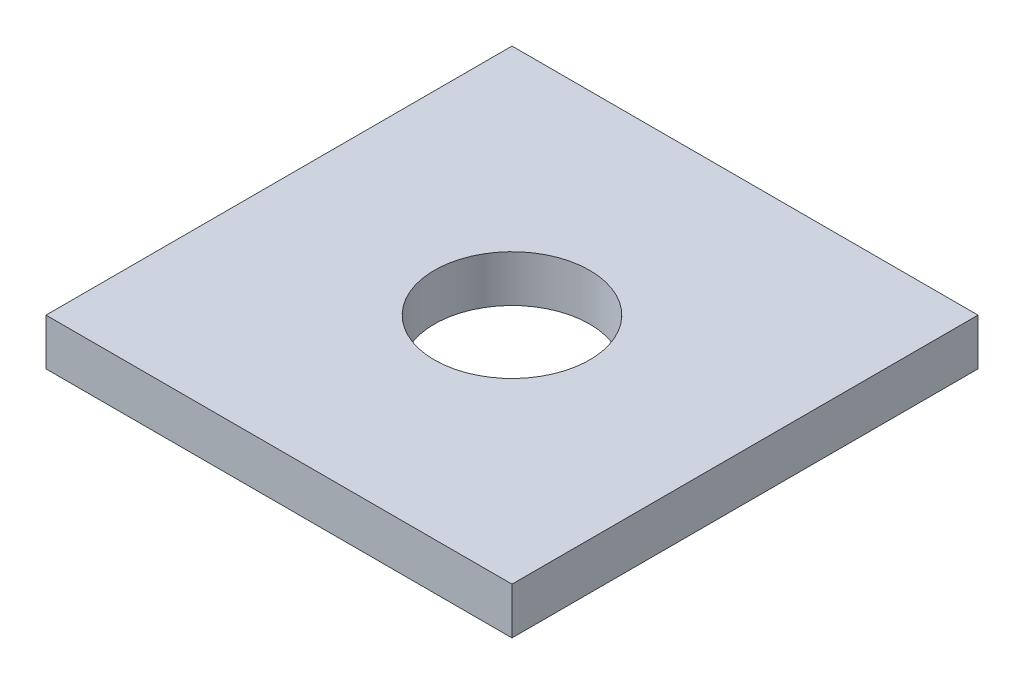
ISO-10303-21;
HEADER;
FILE_DESCRIPTION(('STEP AP214'),'2;1');
FILE_NAME('part.step','',(''),(''),'','','');
FILE_SCHEMA(('AUTOMOTIVE_DESIGN { 1 0 10303 214 1 1 1 1 }'));
ENDSEC;
DATA;
#1=APPLICATION_CONTEXT('core data for automotive mechanical design processes');
#2=APPLICATION_PROTOCOL_DEFINITION('international standard','automotive_design',2000,#1);
#3=PRODUCT_CONTEXT('',#1,'mechanical');
#4=PRODUCT('Part','Part','',(#3));
#5=PRODUCT_RELATED_PRODUCT_CATEGORY('part','',(#4));
#6=PRODUCT_DEFINITION_FORMATION('','',#4);
#7=PRODUCT_DEFINITION_CONTEXT('part definition',#1,'design');
#8=PRODUCT_DEFINITION('design','',#6,#7);
#9=PRODUCT_DEFINITION_SHAPE('','',#8);
#10=(LENGTH_UNIT() NAMED_UNIT(*) SI_UNIT(.MILLI.,.METRE.));
#11=(NAMED_UNIT(*) PLANE_ANGLE_UNIT() SI_UNIT($,.RADIAN.));
#12=(NAMED_UNIT(*) SI_UNIT($,.STERADIAN.) SOLID_ANGLE_UNIT());
#13=UNCERTAINTY_MEASURE_WITH_UNIT(LENGTH_MEASURE(1.E-05),#10,'distance_accuracy_value','');
#14=(GEOMETRIC_REPRESENTATION_CONTEXT(3) GLOBAL_UNCERTAINTY_ASSIGNED_CONTEXT((#13)) GLOBAL_UNIT_ASSIGNED_CONTEXT((#10,
#11,#12)) REPRESENTATION_CONTEXT('',''));
#15=CARTESIAN_POINT('',(0.,0.,0.));
#16=DIRECTION('',(0.,0.,1.));
#17=DIRECTION('',(1.,0.,0.));
#18=AXIS2_PLACEMENT_3D('',#15,#16,#17);
#19=CARTESIAN_POINT('',(0.,3.,0.));
#20=DIRECTION('',(0.,1.,0.));
#21=DIRECTION('',(0.,0.,1.));
#22=AXIS2_PLACEMENT_3D('',#19,#20,#21);
#23=PLANE('',#22);
#24=DIRECTION('',(0.,0.,1.));
#25=VECTOR('',#24,1.);
#26=CARTESIAN_POINT('',(-15.,3.,-15.));
#27=LINE('',#26,#25);
#28=CARTESIAN_POINT('',(-15.,3.,-15.));
#29=VERTEX_POINT('',#28);
#30=CARTESIAN_POINT('',(-15.,3.,15.));
#31=VERTEX_POINT('',#30);
#32=EDGE_CURVE('E85',#29,#31,#27,.T.);
#33=ORIENTED_EDGE('',*,*,#32,.T.);
#34=DIRECTION('',(1.,0.,0.));
#35=VECTOR('',#34,1.);
#36=CARTESIAN_POINT('',(-15.,3.,15.));
#37=LINE('',#36,#35);
#38=CARTESIAN_POINT('',(15.,3.,15.));
#39=VERTEX_POINT('',#38);
#40=EDGE_CURVE('E80',#31,#39,#37,.T.);
#41=ORIENTED_EDGE('',*,*,#40,.T.);
#42=DIRECTION('',(0.,0.,-1.));
#43=VECTOR('',#42,1.);
#44=CARTESIAN_POINT('',(15.,3.,-15.));
#45=LINE('',#44,#43);
#46=CARTESIAN_POINT('',(15.,3.,-15.));
#47=VERTEX_POINT('',#46);
#48=EDGE_CURVE('E83',#39,#47,#45,.T.);
#49=ORIENTED_EDGE('',*,*,#48,.T.);
#50=DIRECTION('',(-1.,0.,0.));
#51=VECTOR('',#50,1.);
#52=CARTESIAN_POINT('',(-15.,3.,-15.));
#53=LINE('',#52,#51);
#54=EDGE_CURVE('E50',#47,#29,#53,.T.);
#55=ORIENTED_EDGE('',*,*,#54,.T.);
#56=EDGE_LOOP('',(#33,#41,#49,#55));
#57=FACE_BOUND('',#56,.T.);
#58=CARTESIAN_POINT('',(0.,3.,0.));
#59=DIRECTION('',(0.,1.,0.));
#60=DIRECTION('',(0.,0.,1.));
#61=AXIS2_PLACEMENT_3D('',#58,#59,#60);
#62=CIRCLE('',#61,5.);
#63=CARTESIAN_POINT('',(0.,3.,5.));
#64=VERTEX_POINT('',#63);
#65=EDGE_CURVE('E100',#64,#64,#62,.T.);
#66=ORIENTED_EDGE('',*,*,#65,.F.);
#67=EDGE_LOOP('',(#66));
#68=FACE_BOUND('',#67,.T.);
#69=ADVANCED_FACE('F33',(#57,#68),#23,.T.);
#70=CARTESIAN_POINT('',(0.,0.,0.));
#71=DIRECTION('',(0.,1.,0.));
#72=DIRECTION('',(0.,0.,1.));
#73=AXIS2_PLACEMENT_3D('',#70,#71,#72);
#74=PLANE('',#73);
#75=DIRECTION('',(0.,0.,1.));
#76=VECTOR('',#75,1.);
#77=CARTESIAN_POINT('',(-15.,0.,-15.));
#78=LINE('',#77,#76);
#79=CARTESIAN_POINT('',(-15.,0.,-15.));
#80=VERTEX_POINT('',#79);
#81=CARTESIAN_POINT('',(-15.,0.,15.));
#82=VERTEX_POINT('',#81);
#83=EDGE_CURVE('E97',#80,#82,#78,.T.);
#84=ORIENTED_EDGE('',*,*,#83,.F.);
#85=DIRECTION('',(-1.,0.,0.));
#86=VECTOR('',#85,1.);
#87=CARTESIAN_POINT('',(-15.,0.,-15.));
#88=LINE('',#87,#86);
#89=CARTESIAN_POINT('',(15.,0.,-15.));
#90=VERTEX_POINT('',#89);
#91=EDGE_CURVE('E73',#90,#80,#88,.T.);
#92=ORIENTED_EDGE('',*,*,#91,.F.);
#93=DIRECTION('',(0.,0.,-1.));
#94=VECTOR('',#93,1.);
#95=CARTESIAN_POINT('',(15.,0.,-15.));
#96=LINE('',#95,#94);
#97=CARTESIAN_POINT('',(15.,0.,15.));
#98=VERTEX_POINT('',#97);
#99=EDGE_CURVE('E67',#98,#90,#96,.T.);
#100=ORIENTED_EDGE('',*,*,#99,.F.);
#101=DIRECTION('',(1.,0.,0.));
#102=VECTOR('',#101,1.);
#103=CARTESIAN_POINT('',(-15.,0.,15.));
#104=LINE('',#103,#102);
#105=EDGE_CURVE('E89',#82,#98,#104,.T.);
#106=ORIENTED_EDGE('',*,*,#105,.F.);
#107=EDGE_LOOP('',(#84,#92,#100,#106));
#108=FACE_BOUND('',#107,.T.);
#109=CARTESIAN_POINT('',(0.,0.,0.));
#110=DIRECTION('',(0.,1.,0.));
#111=DIRECTION('',(0.,0.,1.));
#112=AXIS2_PLACEMENT_3D('',#109,#110,#111);
#113=CIRCLE('',#112,5.);
#114=CARTESIAN_POINT('',(0.,0.,5.));
#115=VERTEX_POINT('',#114);
#116=EDGE_CURVE('E112',#115,#115,#113,.T.);
#117=ORIENTED_EDGE('',*,*,#116,.T.);
#118=EDGE_LOOP('',(#117));
#119=FACE_BOUND('',#118,.T.);
#120=ADVANCED_FACE('F108',(#108,#119),#74,.F.);
#121=CARTESIAN_POINT('',(-15.,3.,-15.));
#122=DIRECTION('',(1.,0.,0.));
#123=DIRECTION('',(0.,0.,-1.));
#124=AXIS2_PLACEMENT_3D('',#121,#122,#123);
#125=PLANE('',#124);
#126=ORIENTED_EDGE('',*,*,#83,.T.);
#127=DIRECTION('',(0.,-1.,0.));
#128=VECTOR('',#127,1.);
#129=CARTESIAN_POINT('',(-15.,3.,15.));
#130=LINE('',#129,#128);
#131=EDGE_CURVE('E11',#31,#82,#130,.T.);
#132=ORIENTED_EDGE('',*,*,#131,.F.);
#133=ORIENTED_EDGE('',*,*,#32,.F.);
#134=DIRECTION('',(0.,-1.,0.));
#135=VECTOR('',#134,1.);
#136=CARTESIAN_POINT('',(-15.,3.,-15.));
#137=LINE('',#136,#135);
#138=EDGE_CURVE('E93',#29,#80,#137,.T.);
#139=ORIENTED_EDGE('',*,*,#138,.T.);
#140=EDGE_LOOP('',(#126,#132,#133,#139));
#141=FACE_BOUND('',#140,.T.);
#142=ADVANCED_FACE('F35',(#141),#125,.F.);
#143=CARTESIAN_POINT('',(-15.,3.,15.));
#144=DIRECTION('',(0.,0.,-1.));
#145=DIRECTION('',(-1.,0.,0.));
#146=AXIS2_PLACEMENT_3D('',#143,#144,#145);
#147=PLANE('',#146);
#148=ORIENTED_EDGE('',*,*,#105,.T.);
#149=DIRECTION('',(0.,-1.,0.));
#150=VECTOR('',#149,1.);
#151=CARTESIAN_POINT('',(15.,3.,15.));
#152=LINE('',#151,#150);
#153=EDGE_CURVE('E42',#39,#98,#152,.T.);
#154=ORIENTED_EDGE('',*,*,#153,.F.);
#155=ORIENTED_EDGE('',*,*,#40,.F.);
#156=ORIENTED_EDGE('',*,*,#131,.T.);
#157=EDGE_LOOP('',(#148,#154,#155,#156));
#158=FACE_BOUND('',#157,.T.);
#159=ADVANCED_FACE('F88',(#158),#147,.F.);
#160=CARTESIAN_POINT('',(15.,3.,-15.));
#161=DIRECTION('',(-1.,0.,0.));
#162=DIRECTION('',(0.,0.,1.));
#163=AXIS2_PLACEMENT_3D('',#160,#161,#162);
#164=PLANE('',#163);
#165=ORIENTED_EDGE('',*,*,#99,.T.);
#166=DIRECTION('',(0.,-1.,0.));
#167=VECTOR('',#166,1.);
#168=CARTESIAN_POINT('',(15.,3.,-15.));
#169=LINE('',#168,#167);
#170=EDGE_CURVE('E90',#47,#90,#169,.T.);
#171=ORIENTED_EDGE('',*,*,#170,.F.);
#172=ORIENTED_EDGE('',*,*,#48,.F.);
#173=ORIENTED_EDGE('',*,*,#153,.T.);
#174=EDGE_LOOP('',(#165,#171,#172,#173));
#175=FACE_BOUND('',#174,.T.);
#176=ADVANCED_FACE('F91',(#175),#164,.F.);
#177=CARTESIAN_POINT('',(-15.,3.,-15.));
#178=DIRECTION('',(0.,0.,1.));
#179=DIRECTION('',(1.,0.,0.));
#180=AXIS2_PLACEMENT_3D('',#177,#178,#179);
#181=PLANE('',#180);
#182=ORIENTED_EDGE('',*,*,#91,.T.);
#183=ORIENTED_EDGE('',*,*,#138,.F.);
#184=ORIENTED_EDGE('',*,*,#54,.F.);
#185=ORIENTED_EDGE('',*,*,#170,.T.);
#186=EDGE_LOOP('',(#182,#183,#184,#185));
#187=FACE_BOUND('',#186,.T.);
#188=ADVANCED_FACE('F105',(#187),#181,.F.);
#189=CARTESIAN_POINT('',(0.,3.,0.));
#190=DIRECTION('',(0.,-1.,0.));
#191=DIRECTION('',(0.,0.,-1.));
#192=AXIS2_PLACEMENT_3D('',#189,#190,#191);
#193=CYLINDRICAL_SURFACE('',#192,5.);
#194=ORIENTED_EDGE('',*,*,#65,.T.);
#195=EDGE_LOOP('',(#194));
#196=FACE_BOUND('',#195,.T.);
#197=ORIENTED_EDGE('',*,*,#116,.F.);
#198=EDGE_LOOP('',(#197));
#199=FACE_BOUND('',#198,.T.);
#200=ADVANCED_FACE('F118',(#196,#199),#193,.F.);
#201=CLOSED_SHELL('',(#69,#120,#142,#159,#176,#188,#200));
#202=MANIFOLD_SOLID_BREP('B2',#201);
#203=ADVANCED_BREP_SHAPE_REPRESENTATION('',(#18,#202),#14);
#204=SHAPE_DEFINITION_REPRESENTATION(#9,#203);
ENDSEC;
END-ISO-10303-21;
